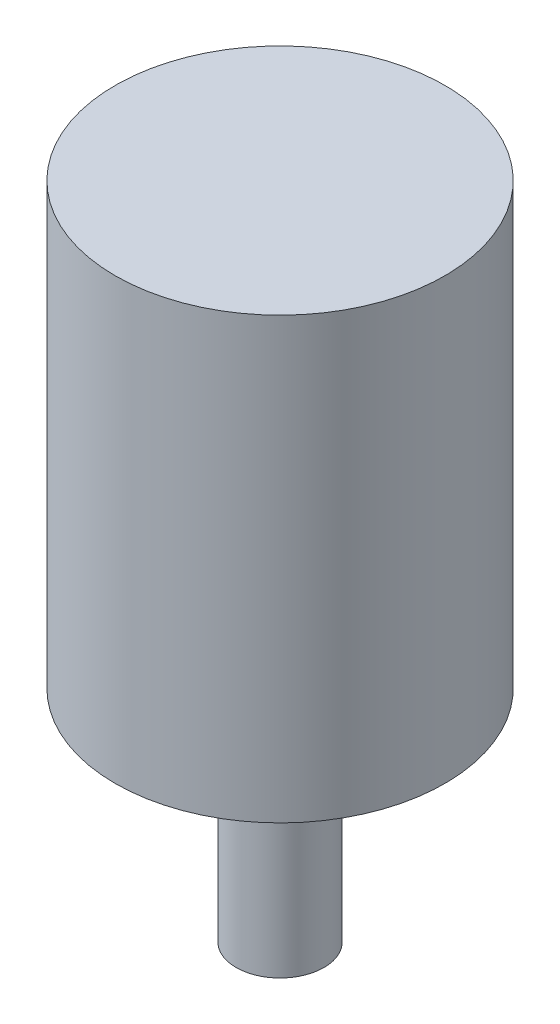
ISO-10303-21;
HEADER;
FILE_DESCRIPTION(('STEP AP214'),'2;1');
FILE_NAME('part.step','',(''),(''),'','','');
FILE_SCHEMA(('AUTOMOTIVE_DESIGN { 1 0 10303 214 1 1 1 1 }'));
ENDSEC;
DATA;
#1=APPLICATION_CONTEXT('core data for automotive mechanical design processes');
#2=APPLICATION_PROTOCOL_DEFINITION('international standard','automotive_design',2000,#1);
#3=PRODUCT_CONTEXT('',#1,'mechanical');
#4=PRODUCT('Part','Part','',(#3));
#5=PRODUCT_RELATED_PRODUCT_CATEGORY('part','',(#4));
#6=PRODUCT_DEFINITION_FORMATION('','',#4);
#7=PRODUCT_DEFINITION_CONTEXT('part definition',#1,'design');
#8=PRODUCT_DEFINITION('design','',#6,#7);
#9=PRODUCT_DEFINITION_SHAPE('','',#8);
#10=(LENGTH_UNIT() NAMED_UNIT(*) SI_UNIT(.MILLI.,.METRE.));
#11=(NAMED_UNIT(*) PLANE_ANGLE_UNIT() SI_UNIT($,.RADIAN.));
#12=(NAMED_UNIT(*) SI_UNIT($,.STERADIAN.) SOLID_ANGLE_UNIT());
#13=UNCERTAINTY_MEASURE_WITH_UNIT(LENGTH_MEASURE(1.E-05),#10,'distance_accuracy_value','');
#14=(GEOMETRIC_REPRESENTATION_CONTEXT(3) GLOBAL_UNCERTAINTY_ASSIGNED_CONTEXT((#13)) GLOBAL_UNIT_ASSIGNED_CONTEXT((#10,
#11,#12)) REPRESENTATION_CONTEXT('',''));
#15=CARTESIAN_POINT('',(0.,0.,0.));
#16=DIRECTION('',(0.,0.,1.));
#17=DIRECTION('',(1.,0.,0.));
#18=AXIS2_PLACEMENT_3D('',#15,#16,#17);
#19=CARTESIAN_POINT('',(0.,0.,0.));
#20=DIRECTION('',(0.,1.,0.));
#21=DIRECTION('',(0.,0.,1.));
#22=AXIS2_PLACEMENT_3D('',#19,#20,#21);
#23=PLANE('',#22);
#24=CARTESIAN_POINT('',(0.,0.,0.));
#25=DIRECTION('',(0.,1.,0.));
#26=DIRECTION('',(0.,0.,1.));
#27=AXIS2_PLACEMENT_3D('',#24,#25,#26);
#28=CIRCLE('',#27,0.375);
#29=CARTESIAN_POINT('',(0.,0.,0.375));
#30=VERTEX_POINT('',#29);
#31=EDGE_CURVE('E50',#30,#30,#28,.T.);
#32=ORIENTED_EDGE('',*,*,#31,.F.);
#33=EDGE_LOOP('',(#32));
#34=FACE_BOUND('',#33,.T.);
#35=CARTESIAN_POINT('',(0.,0.,0.));
#36=DIRECTION('',(0.,1.,0.));
#37=DIRECTION('',(0.,0.,1.));
#38=AXIS2_PLACEMENT_3D('',#35,#36,#37);
#39=CIRCLE('',#38,0.1);
#40=CARTESIAN_POINT('',(0.,0.,0.1));
#41=VERTEX_POINT('',#40);
#42=EDGE_CURVE('E10',#41,#41,#39,.F.);
#43=ORIENTED_EDGE('',*,*,#42,.F.);
#44=EDGE_LOOP('',(#43));
#45=FACE_BOUND('',#44,.T.);
#46=ADVANCED_FACE('F39',(#34,#45),#23,.F.);
#47=CARTESIAN_POINT('',(0.,1.,0.));
#48=DIRECTION('',(0.,-1.,0.));
#49=DIRECTION('',(0.,0.,-1.));
#50=AXIS2_PLACEMENT_3D('',#47,#48,#49);
#51=CYLINDRICAL_SURFACE('',#50,0.375);
#52=CARTESIAN_POINT('',(0.,1.,0.));
#53=DIRECTION('',(0.,1.,0.));
#54=DIRECTION('',(0.,0.,1.));
#55=AXIS2_PLACEMENT_3D('',#52,#53,#54);
#56=CIRCLE('',#55,0.375);
#57=CARTESIAN_POINT('',(0.,1.,0.375));
#58=VERTEX_POINT('',#57);
#59=EDGE_CURVE('E46',#58,#58,#56,.T.);
#60=ORIENTED_EDGE('',*,*,#59,.F.);
#61=EDGE_LOOP('',(#60));
#62=FACE_BOUND('',#61,.T.);
#63=ORIENTED_EDGE('',*,*,#31,.T.);
#64=EDGE_LOOP('',(#63));
#65=FACE_BOUND('',#64,.T.);
#66=ADVANCED_FACE('F41',(#62,#65),#51,.T.);
#67=CARTESIAN_POINT('',(0.,1.,0.));
#68=DIRECTION('',(0.,1.,0.));
#69=DIRECTION('',(0.,0.,1.));
#70=AXIS2_PLACEMENT_3D('',#67,#68,#69);
#71=PLANE('',#70);
#72=ORIENTED_EDGE('',*,*,#59,.T.);
#73=EDGE_LOOP('',(#72));
#74=FACE_BOUND('',#73,.T.);
#75=ADVANCED_FACE('F64',(#74),#71,.T.);
#76=CARTESIAN_POINT('',(0.,-0.5,0.));
#77=DIRECTION('',(0.,1.,0.));
#78=DIRECTION('',(0.,0.,1.));
#79=AXIS2_PLACEMENT_3D('',#76,#77,#78);
#80=CYLINDRICAL_SURFACE('',#79,0.1);
#81=CARTESIAN_POINT('',(0.,-0.5,0.));
#82=DIRECTION('',(0.,-1.,0.));
#83=DIRECTION('',(0.,0.,-1.));
#84=AXIS2_PLACEMENT_3D('',#81,#82,#83);
#85=CIRCLE('',#84,0.1);
#86=CARTESIAN_POINT('',(0.,-0.5,-0.1));
#87=VERTEX_POINT('',#86);
#88=EDGE_CURVE('E55',#87,#87,#85,.T.);
#89=ORIENTED_EDGE('',*,*,#88,.F.);
#90=EDGE_LOOP('',(#89));
#91=FACE_BOUND('',#90,.T.);
#92=ORIENTED_EDGE('',*,*,#42,.T.);
#93=EDGE_LOOP('',(#92));
#94=FACE_BOUND('',#93,.T.);
#95=ADVANCED_FACE('F62',(#91,#94),#80,.T.);
#96=CARTESIAN_POINT('',(0.,-0.5,0.));
#97=DIRECTION('',(0.,-1.,0.));
#98=DIRECTION('',(0.,0.,-1.));
#99=AXIS2_PLACEMENT_3D('',#96,#97,#98);
#100=PLANE('',#99);
#101=ORIENTED_EDGE('',*,*,#88,.T.);
#102=EDGE_LOOP('',(#101));
#103=FACE_BOUND('',#102,.T.);
#104=ADVANCED_FACE('F60',(#103),#100,.T.);
#105=CLOSED_SHELL('',(#46,#66,#75,#95,#104));
#106=MANIFOLD_SOLID_BREP('B2',#105);
#107=ADVANCED_BREP_SHAPE_REPRESENTATION('',(#18,#106),#14);
#108=SHAPE_DEFINITION_REPRESENTATION(#9,#107);
ENDSEC;
END-ISO-10303-21;
